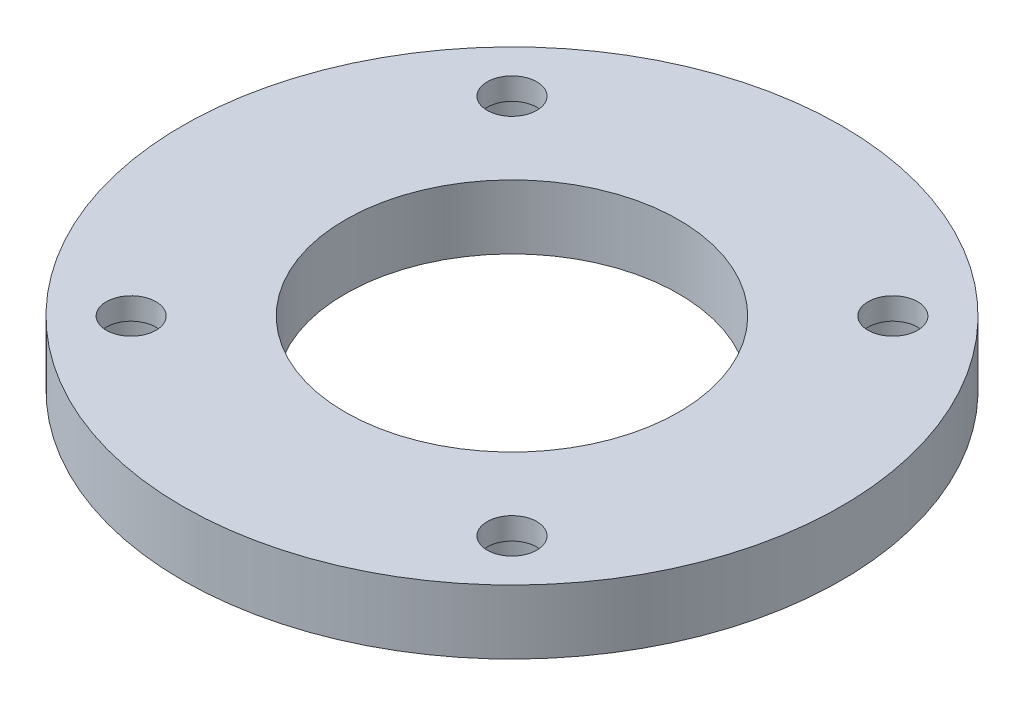
ISO-10303-21;
HEADER;
FILE_DESCRIPTION(('STEP AP214'),'2;1');
FILE_NAME('part.step','',(''),(''),'','','');
FILE_SCHEMA(('AUTOMOTIVE_DESIGN { 1 0 10303 214 1 1 1 1 }'));
ENDSEC;
DATA;
#1=APPLICATION_CONTEXT('core data for automotive mechanical design processes');
#2=APPLICATION_PROTOCOL_DEFINITION('international standard','automotive_design',2000,#1);
#3=PRODUCT_CONTEXT('',#1,'mechanical');
#4=PRODUCT('Part','Part','',(#3));
#5=PRODUCT_RELATED_PRODUCT_CATEGORY('part','',(#4));
#6=PRODUCT_DEFINITION_FORMATION('','',#4);
#7=PRODUCT_DEFINITION_CONTEXT('part definition',#1,'design');
#8=PRODUCT_DEFINITION('design','',#6,#7);
#9=PRODUCT_DEFINITION_SHAPE('','',#8);
#10=(LENGTH_UNIT() NAMED_UNIT(*) SI_UNIT(.MILLI.,.METRE.));
#11=(NAMED_UNIT(*) PLANE_ANGLE_UNIT() SI_UNIT($,.RADIAN.));
#12=(NAMED_UNIT(*) SI_UNIT($,.STERADIAN.) SOLID_ANGLE_UNIT());
#13=UNCERTAINTY_MEASURE_WITH_UNIT(LENGTH_MEASURE(1.E-05),#10,'distance_accuracy_value','');
#14=(GEOMETRIC_REPRESENTATION_CONTEXT(3) GLOBAL_UNCERTAINTY_ASSIGNED_CONTEXT((#13)) GLOBAL_UNIT_ASSIGNED_CONTEXT((#10,
#11,#12)) REPRESENTATION_CONTEXT('',''));
#15=CARTESIAN_POINT('',(0.,0.,0.));
#16=DIRECTION('',(0.,0.,1.));
#17=DIRECTION('',(1.,0.,0.));
#18=AXIS2_PLACEMENT_3D('',#15,#16,#17);
#19=CARTESIAN_POINT('',(0.,6.35,0.));
#20=DIRECTION('',(0.,1.,0.));
#21=DIRECTION('',(0.,0.,1.));
#22=AXIS2_PLACEMENT_3D('',#19,#20,#21);
#23=PLANE('',#22);
#24=CARTESIAN_POINT('',(-18.8585378542452,6.35,18.8585378542452));
#25=DIRECTION('',(0.,-1.,0.));
#26=DIRECTION('',(0.,0.,-1.));
#27=AXIS2_PLACEMENT_3D('',#24,#25,#26);
#28=CIRCLE('',#27,2.45745);
#29=CARTESIAN_POINT('',(-18.8585378542452,6.35,16.4010878542452));
#30=VERTEX_POINT('',#29);
#31=EDGE_CURVE('E84',#30,#30,#28,.T.);
#32=ORIENTED_EDGE('',*,*,#31,.T.);
#33=EDGE_LOOP('',(#32));
#34=FACE_BOUND('',#33,.T.);
#35=CARTESIAN_POINT('',(18.8585378542452,6.35,18.8585378542452));
#36=DIRECTION('',(0.,-1.,0.));
#37=DIRECTION('',(0.,0.,-1.));
#38=AXIS2_PLACEMENT_3D('',#35,#36,#37);
#39=CIRCLE('',#38,2.45745);
#40=CARTESIAN_POINT('',(18.8585378542452,6.35,16.4010878542452));
#41=VERTEX_POINT('',#40);
#42=EDGE_CURVE('E72',#41,#41,#39,.T.);
#43=ORIENTED_EDGE('',*,*,#42,.T.);
#44=EDGE_LOOP('',(#43));
#45=FACE_BOUND('',#44,.T.);
#46=CARTESIAN_POINT('',(18.8585378542452,6.35,-18.8585378542452));
#47=DIRECTION('',(0.,-1.,0.));
#48=DIRECTION('',(0.,0.,-1.));
#49=AXIS2_PLACEMENT_3D('',#46,#47,#48);
#50=CIRCLE('',#49,2.45745);
#51=CARTESIAN_POINT('',(18.8585378542452,6.35,-21.3159878542452));
#52=VERTEX_POINT('',#51);
#53=EDGE_CURVE('E60',#52,#52,#50,.T.);
#54=ORIENTED_EDGE('',*,*,#53,.T.);
#55=EDGE_LOOP('',(#54));
#56=FACE_BOUND('',#55,.T.);
#57=CARTESIAN_POINT('',(-18.8585378542452,6.35,-18.8585378542452));
#58=DIRECTION('',(0.,-1.,0.));
#59=DIRECTION('',(0.,0.,-1.));
#60=AXIS2_PLACEMENT_3D('',#57,#58,#59);
#61=CIRCLE('',#60,2.45745);
#62=CARTESIAN_POINT('',(-18.8585378542452,6.35,-21.3159878542452));
#63=VERTEX_POINT('',#62);
#64=EDGE_CURVE('E46',#63,#63,#61,.T.);
#65=ORIENTED_EDGE('',*,*,#64,.T.);
#66=EDGE_LOOP('',(#65));
#67=FACE_BOUND('',#66,.T.);
#68=CARTESIAN_POINT('',(0.,6.35,0.));
#69=DIRECTION('',(0.,1.,0.));
#70=DIRECTION('',(0.,0.,1.));
#71=AXIS2_PLACEMENT_3D('',#68,#69,#70);
#72=CIRCLE('',#71,32.639);
#73=CARTESIAN_POINT('',(0.,6.35,32.639));
#74=VERTEX_POINT('',#73);
#75=EDGE_CURVE('E10',#74,#74,#72,.T.);
#76=ORIENTED_EDGE('',*,*,#75,.T.);
#77=EDGE_LOOP('',(#76));
#78=FACE_BOUND('',#77,.T.);
#79=CARTESIAN_POINT('',(0.,6.35,0.));
#80=DIRECTION('',(0.,1.,0.));
#81=DIRECTION('',(0.,0.,1.));
#82=AXIS2_PLACEMENT_3D('',#79,#80,#81);
#83=CIRCLE('',#82,16.51);
#84=CARTESIAN_POINT('',(0.,6.35,16.51));
#85=VERTEX_POINT('',#84);
#86=EDGE_CURVE('E41',#85,#85,#83,.T.);
#87=ORIENTED_EDGE('',*,*,#86,.F.);
#88=EDGE_LOOP('',(#87));
#89=FACE_BOUND('',#88,.T.);
#90=ADVANCED_FACE('F30',(#34,#45,#56,#67,#78,#89),#23,.T.);
#91=CARTESIAN_POINT('',(0.,0.,0.));
#92=DIRECTION('',(0.,1.,0.));
#93=DIRECTION('',(0.,0.,1.));
#94=AXIS2_PLACEMENT_3D('',#91,#92,#93);
#95=PLANE('',#94);
#96=CARTESIAN_POINT('',(-18.8585378542452,0.,18.8585378542452));
#97=DIRECTION('',(0.,-1.,0.));
#98=DIRECTION('',(0.,0.,-1.));
#99=AXIS2_PLACEMENT_3D('',#96,#97,#98);
#100=CIRCLE('',#99,3.96875);
#101=CARTESIAN_POINT('',(-18.8585378542452,0.,14.8897878542452));
#102=VERTEX_POINT('',#101);
#103=EDGE_CURVE('E93',#102,#102,#100,.T.);
#104=ORIENTED_EDGE('',*,*,#103,.F.);
#105=EDGE_LOOP('',(#104));
#106=FACE_BOUND('',#105,.T.);
#107=CARTESIAN_POINT('',(18.8585378542452,0.,18.8585378542452));
#108=DIRECTION('',(0.,-1.,0.));
#109=DIRECTION('',(0.,0.,-1.));
#110=AXIS2_PLACEMENT_3D('',#107,#108,#109);
#111=CIRCLE('',#110,3.96875);
#112=CARTESIAN_POINT('',(18.8585378542452,0.,14.8897878542452));
#113=VERTEX_POINT('',#112);
#114=EDGE_CURVE('E81',#113,#113,#111,.T.);
#115=ORIENTED_EDGE('',*,*,#114,.F.);
#116=EDGE_LOOP('',(#115));
#117=FACE_BOUND('',#116,.T.);
#118=CARTESIAN_POINT('',(18.8585378542452,0.,-18.8585378542452));
#119=DIRECTION('',(0.,-1.,0.));
#120=DIRECTION('',(0.,0.,-1.));
#121=AXIS2_PLACEMENT_3D('',#118,#119,#120);
#122=CIRCLE('',#121,3.96875);
#123=CARTESIAN_POINT('',(18.8585378542452,0.,-22.8272878542452));
#124=VERTEX_POINT('',#123);
#125=EDGE_CURVE('E69',#124,#124,#122,.T.);
#126=ORIENTED_EDGE('',*,*,#125,.F.);
#127=EDGE_LOOP('',(#126));
#128=FACE_BOUND('',#127,.T.);
#129=CARTESIAN_POINT('',(-18.8585378542452,0.,-18.8585378542452));
#130=DIRECTION('',(0.,-1.,0.));
#131=DIRECTION('',(0.,0.,-1.));
#132=AXIS2_PLACEMENT_3D('',#129,#130,#131);
#133=CIRCLE('',#132,3.96875);
#134=CARTESIAN_POINT('',(-18.8585378542452,0.,-22.8272878542452));
#135=VERTEX_POINT('',#134);
#136=EDGE_CURVE('E57',#135,#135,#133,.T.);
#137=ORIENTED_EDGE('',*,*,#136,.F.);
#138=EDGE_LOOP('',(#137));
#139=FACE_BOUND('',#138,.T.);
#140=CARTESIAN_POINT('',(0.,0.,0.));
#141=DIRECTION('',(0.,1.,0.));
#142=DIRECTION('',(0.,0.,1.));
#143=AXIS2_PLACEMENT_3D('',#140,#141,#142);
#144=CIRCLE('',#143,32.639);
#145=CARTESIAN_POINT('',(0.,0.,32.639));
#146=VERTEX_POINT('',#145);
#147=EDGE_CURVE('E34',#146,#146,#144,.T.);
#148=ORIENTED_EDGE('',*,*,#147,.F.);
#149=EDGE_LOOP('',(#148));
#150=FACE_BOUND('',#149,.T.);
#151=CARTESIAN_POINT('',(0.,0.,0.));
#152=DIRECTION('',(0.,1.,0.));
#153=DIRECTION('',(0.,0.,1.));
#154=AXIS2_PLACEMENT_3D('',#151,#152,#153);
#155=CIRCLE('',#154,16.51);
#156=CARTESIAN_POINT('',(0.,0.,16.51));
#157=VERTEX_POINT('',#156);
#158=EDGE_CURVE('E43',#157,#157,#155,.T.);
#159=ORIENTED_EDGE('',*,*,#158,.T.);
#160=EDGE_LOOP('',(#159));
#161=FACE_BOUND('',#160,.T.);
#162=ADVANCED_FACE('F99',(#106,#117,#128,#139,#150,#161),#95,.F.);
#163=CARTESIAN_POINT('',(0.,6.35,0.));
#164=DIRECTION('',(0.,-1.,0.));
#165=DIRECTION('',(0.,0.,-1.));
#166=AXIS2_PLACEMENT_3D('',#163,#164,#165);
#167=CYLINDRICAL_SURFACE('',#166,32.639);
#168=ORIENTED_EDGE('',*,*,#75,.F.);
#169=EDGE_LOOP('',(#168));
#170=FACE_BOUND('',#169,.T.);
#171=ORIENTED_EDGE('',*,*,#147,.T.);
#172=EDGE_LOOP('',(#171));
#173=FACE_BOUND('',#172,.T.);
#174=ADVANCED_FACE('F32',(#170,#173),#167,.T.);
#175=CARTESIAN_POINT('',(0.,6.35,0.));
#176=DIRECTION('',(0.,-1.,0.));
#177=DIRECTION('',(0.,0.,-1.));
#178=AXIS2_PLACEMENT_3D('',#175,#176,#177);
#179=CYLINDRICAL_SURFACE('',#178,16.51);
#180=ORIENTED_EDGE('',*,*,#86,.T.);
#181=EDGE_LOOP('',(#180));
#182=FACE_BOUND('',#181,.T.);
#183=ORIENTED_EDGE('',*,*,#158,.F.);
#184=EDGE_LOOP('',(#183));
#185=FACE_BOUND('',#184,.T.);
#186=ADVANCED_FACE('F112',(#182,#185),#179,.F.);
#187=CARTESIAN_POINT('',(-18.8585378542452,0.,-18.8585378542452));
#188=DIRECTION('',(0.,-1.,0.));
#189=DIRECTION('',(0.,0.,-1.));
#190=AXIS2_PLACEMENT_3D('',#187,#188,#189);
#191=CYLINDRICAL_SURFACE('',#190,2.45745);
#192=ORIENTED_EDGE('',*,*,#64,.F.);
#193=EDGE_LOOP('',(#192));
#194=FACE_BOUND('',#193,.T.);
#195=CARTESIAN_POINT('',(-18.8585378542452,4.1656,-18.8585378542452));
#196=DIRECTION('',(0.,-1.,0.));
#197=DIRECTION('',(0.,0.,-1.));
#198=AXIS2_PLACEMENT_3D('',#195,#196,#197);
#199=CIRCLE('',#198,2.45745);
#200=CARTESIAN_POINT('',(-18.8585378542452,4.1656,-21.3159878542452));
#201=VERTEX_POINT('',#200);
#202=EDGE_CURVE('E51',#201,#201,#199,.T.);
#203=ORIENTED_EDGE('',*,*,#202,.T.);
#204=EDGE_LOOP('',(#203));
#205=FACE_BOUND('',#204,.T.);
#206=ADVANCED_FACE('F114',(#194,#205),#191,.F.);
#207=CARTESIAN_POINT('',(-16.4010878542452,4.1656,-18.8585378542452));
#208=DIRECTION('',(0.,1.,0.));
#209=DIRECTION('',(0.,0.,1.));
#210=AXIS2_PLACEMENT_3D('',#207,#208,#209);
#211=PLANE('',#210);
#212=ORIENTED_EDGE('',*,*,#202,.F.);
#213=EDGE_LOOP('',(#212));
#214=FACE_BOUND('',#213,.T.);
#215=CARTESIAN_POINT('',(-18.8585378542452,4.1656,-18.8585378542452));
#216=DIRECTION('',(0.,-1.,0.));
#217=DIRECTION('',(0.,0.,-1.));
#218=AXIS2_PLACEMENT_3D('',#215,#216,#217);
#219=CIRCLE('',#218,3.96875);
#220=CARTESIAN_POINT('',(-18.8585378542452,4.1656,-22.8272878542452));
#221=VERTEX_POINT('',#220);
#222=EDGE_CURVE('E54',#221,#221,#219,.T.);
#223=ORIENTED_EDGE('',*,*,#222,.T.);
#224=EDGE_LOOP('',(#223));
#225=FACE_BOUND('',#224,.T.);
#226=ADVANCED_FACE('F121',(#214,#225),#211,.F.);
#227=CARTESIAN_POINT('',(-18.8585378542452,0.,-18.8585378542452));
#228=DIRECTION('',(0.,-1.,0.));
#229=DIRECTION('',(0.,0.,-1.));
#230=AXIS2_PLACEMENT_3D('',#227,#228,#229);
#231=CYLINDRICAL_SURFACE('',#230,3.96875);
#232=ORIENTED_EDGE('',*,*,#222,.F.);
#233=EDGE_LOOP('',(#232));
#234=FACE_BOUND('',#233,.T.);
#235=ORIENTED_EDGE('',*,*,#136,.T.);
#236=EDGE_LOOP('',(#235));
#237=FACE_BOUND('',#236,.T.);
#238=ADVANCED_FACE('F144',(#234,#237),#231,.F.);
#239=CARTESIAN_POINT('',(18.8585378542452,0.,-18.8585378542452));
#240=DIRECTION('',(0.,-1.,0.));
#241=DIRECTION('',(0.,0.,-1.));
#242=AXIS2_PLACEMENT_3D('',#239,#240,#241);
#243=CYLINDRICAL_SURFACE('',#242,2.45745);
#244=ORIENTED_EDGE('',*,*,#53,.F.);
#245=EDGE_LOOP('',(#244));
#246=FACE_BOUND('',#245,.T.);
#247=CARTESIAN_POINT('',(18.8585378542452,4.1656,-18.8585378542452));
#248=DIRECTION('',(0.,-1.,0.));
#249=DIRECTION('',(0.,0.,-1.));
#250=AXIS2_PLACEMENT_3D('',#247,#248,#249);
#251=CIRCLE('',#250,2.45745);
#252=CARTESIAN_POINT('',(18.8585378542452,4.1656,-21.3159878542452));
#253=VERTEX_POINT('',#252);
#254=EDGE_CURVE('E63',#253,#253,#251,.T.);
#255=ORIENTED_EDGE('',*,*,#254,.T.);
#256=EDGE_LOOP('',(#255));
#257=FACE_BOUND('',#256,.T.);
#258=ADVANCED_FACE('F150',(#246,#257),#243,.F.);
#259=CARTESIAN_POINT('',(21.3159878542452,4.1656,-18.8585378542452));
#260=DIRECTION('',(0.,1.,0.));
#261=DIRECTION('',(0.,0.,1.));
#262=AXIS2_PLACEMENT_3D('',#259,#260,#261);
#263=PLANE('',#262);
#264=ORIENTED_EDGE('',*,*,#254,.F.);
#265=EDGE_LOOP('',(#264));
#266=FACE_BOUND('',#265,.T.);
#267=CARTESIAN_POINT('',(18.8585378542452,4.1656,-18.8585378542452));
#268=DIRECTION('',(0.,-1.,0.));
#269=DIRECTION('',(0.,0.,-1.));
#270=AXIS2_PLACEMENT_3D('',#267,#268,#269);
#271=CIRCLE('',#270,3.96875);
#272=CARTESIAN_POINT('',(18.8585378542452,4.1656,-22.8272878542452));
#273=VERTEX_POINT('',#272);
#274=EDGE_CURVE('E66',#273,#273,#271,.T.);
#275=ORIENTED_EDGE('',*,*,#274,.T.);
#276=EDGE_LOOP('',(#275));
#277=FACE_BOUND('',#276,.T.);
#278=ADVANCED_FACE('F155',(#266,#277),#263,.F.);
#279=CARTESIAN_POINT('',(18.8585378542452,0.,-18.8585378542452));
#280=DIRECTION('',(0.,-1.,0.));
#281=DIRECTION('',(0.,0.,-1.));
#282=AXIS2_PLACEMENT_3D('',#279,#280,#281);
#283=CYLINDRICAL_SURFACE('',#282,3.96875);
#284=ORIENTED_EDGE('',*,*,#274,.F.);
#285=EDGE_LOOP('',(#284));
#286=FACE_BOUND('',#285,.T.);
#287=ORIENTED_EDGE('',*,*,#125,.T.);
#288=EDGE_LOOP('',(#287));
#289=FACE_BOUND('',#288,.T.);
#290=ADVANCED_FACE('F161',(#286,#289),#283,.F.);
#291=CARTESIAN_POINT('',(18.8585378542452,0.,18.8585378542452));
#292=DIRECTION('',(0.,-1.,0.));
#293=DIRECTION('',(0.,0.,-1.));
#294=AXIS2_PLACEMENT_3D('',#291,#292,#293);
#295=CYLINDRICAL_SURFACE('',#294,2.45745);
#296=ORIENTED_EDGE('',*,*,#42,.F.);
#297=EDGE_LOOP('',(#296));
#298=FACE_BOUND('',#297,.T.);
#299=CARTESIAN_POINT('',(18.8585378542452,4.1656,18.8585378542452));
#300=DIRECTION('',(0.,-1.,0.));
#301=DIRECTION('',(0.,0.,-1.));
#302=AXIS2_PLACEMENT_3D('',#299,#300,#301);
#303=CIRCLE('',#302,2.45745);
#304=CARTESIAN_POINT('',(18.8585378542452,4.1656,16.4010878542452));
#305=VERTEX_POINT('',#304);
#306=EDGE_CURVE('E75',#305,#305,#303,.T.);
#307=ORIENTED_EDGE('',*,*,#306,.T.);
#308=EDGE_LOOP('',(#307));
#309=FACE_BOUND('',#308,.T.);
#310=ADVANCED_FACE('F165',(#298,#309),#295,.F.);
#311=CARTESIAN_POINT('',(21.3159878542452,4.1656,18.8585378542452));
#312=DIRECTION('',(0.,1.,0.));
#313=DIRECTION('',(0.,0.,1.));
#314=AXIS2_PLACEMENT_3D('',#311,#312,#313);
#315=PLANE('',#314);
#316=ORIENTED_EDGE('',*,*,#306,.F.);
#317=EDGE_LOOP('',(#316));
#318=FACE_BOUND('',#317,.T.);
#319=CARTESIAN_POINT('',(18.8585378542452,4.1656,18.8585378542452));
#320=DIRECTION('',(0.,-1.,0.));
#321=DIRECTION('',(0.,0.,-1.));
#322=AXIS2_PLACEMENT_3D('',#319,#320,#321);
#323=CIRCLE('',#322,3.96875);
#324=CARTESIAN_POINT('',(18.8585378542452,4.1656,14.8897878542452));
#325=VERTEX_POINT('',#324);
#326=EDGE_CURVE('E78',#325,#325,#323,.T.);
#327=ORIENTED_EDGE('',*,*,#326,.T.);
#328=EDGE_LOOP('',(#327));
#329=FACE_BOUND('',#328,.T.);
#330=ADVANCED_FACE('F169',(#318,#329),#315,.F.);
#331=CARTESIAN_POINT('',(18.8585378542452,0.,18.8585378542452));
#332=DIRECTION('',(0.,-1.,0.));
#333=DIRECTION('',(0.,0.,-1.));
#334=AXIS2_PLACEMENT_3D('',#331,#332,#333);
#335=CYLINDRICAL_SURFACE('',#334,3.96875);
#336=ORIENTED_EDGE('',*,*,#326,.F.);
#337=EDGE_LOOP('',(#336));
#338=FACE_BOUND('',#337,.T.);
#339=ORIENTED_EDGE('',*,*,#114,.T.);
#340=EDGE_LOOP('',(#339));
#341=FACE_BOUND('',#340,.T.);
#342=ADVANCED_FACE('F173',(#338,#341),#335,.F.);
#343=CARTESIAN_POINT('',(-18.8585378542452,0.,18.8585378542452));
#344=DIRECTION('',(0.,-1.,0.));
#345=DIRECTION('',(0.,0.,-1.));
#346=AXIS2_PLACEMENT_3D('',#343,#344,#345);
#347=CYLINDRICAL_SURFACE('',#346,2.45745);
#348=ORIENTED_EDGE('',*,*,#31,.F.);
#349=EDGE_LOOP('',(#348));
#350=FACE_BOUND('',#349,.T.);
#351=CARTESIAN_POINT('',(-18.8585378542452,4.1656,18.8585378542452));
#352=DIRECTION('',(0.,-1.,0.));
#353=DIRECTION('',(0.,0.,-1.));
#354=AXIS2_PLACEMENT_3D('',#351,#352,#353);
#355=CIRCLE('',#354,2.45745);
#356=CARTESIAN_POINT('',(-18.8585378542452,4.1656,16.4010878542452));
#357=VERTEX_POINT('',#356);
#358=EDGE_CURVE('E87',#357,#357,#355,.T.);
#359=ORIENTED_EDGE('',*,*,#358,.T.);
#360=EDGE_LOOP('',(#359));
#361=FACE_BOUND('',#360,.T.);
#362=ADVANCED_FACE('F177',(#350,#361),#347,.F.);
#363=CARTESIAN_POINT('',(-16.4010878542452,4.1656,18.8585378542452));
#364=DIRECTION('',(0.,1.,0.));
#365=DIRECTION('',(0.,0.,1.));
#366=AXIS2_PLACEMENT_3D('',#363,#364,#365);
#367=PLANE('',#366);
#368=ORIENTED_EDGE('',*,*,#358,.F.);
#369=EDGE_LOOP('',(#368));
#370=FACE_BOUND('',#369,.T.);
#371=CARTESIAN_POINT('',(-18.8585378542452,4.1656,18.8585378542452));
#372=DIRECTION('',(0.,-1.,0.));
#373=DIRECTION('',(0.,0.,-1.));
#374=AXIS2_PLACEMENT_3D('',#371,#372,#373);
#375=CIRCLE('',#374,3.96875);
#376=CARTESIAN_POINT('',(-18.8585378542452,4.1656,14.8897878542452));
#377=VERTEX_POINT('',#376);
#378=EDGE_CURVE('E90',#377,#377,#375,.T.);
#379=ORIENTED_EDGE('',*,*,#378,.T.);
#380=EDGE_LOOP('',(#379));
#381=FACE_BOUND('',#380,.T.);
#382=ADVANCED_FACE('F181',(#370,#381),#367,.F.);
#383=CARTESIAN_POINT('',(-18.8585378542452,0.,18.8585378542452));
#384=DIRECTION('',(0.,-1.,0.));
#385=DIRECTION('',(0.,0.,-1.));
#386=AXIS2_PLACEMENT_3D('',#383,#384,#385);
#387=CYLINDRICAL_SURFACE('',#386,3.96875);
#388=ORIENTED_EDGE('',*,*,#378,.F.);
#389=EDGE_LOOP('',(#388));
#390=FACE_BOUND('',#389,.T.);
#391=ORIENTED_EDGE('',*,*,#103,.T.);
#392=EDGE_LOOP('',(#391));
#393=FACE_BOUND('',#392,.T.);
#394=ADVANCED_FACE('F97',(#390,#393),#387,.F.);
#395=CLOSED_SHELL('',(#90,#162,#174,#186,#206,#226,#238,#258,#278,#290,#310,#330,#342,#362,#382,#394));
#396=MANIFOLD_SOLID_BREP('B2',#395);
#397=ADVANCED_BREP_SHAPE_REPRESENTATION('',(#18,#396),#14);
#398=SHAPE_DEFINITION_REPRESENTATION(#9,#397);
ENDSEC;
END-ISO-10303-21;
